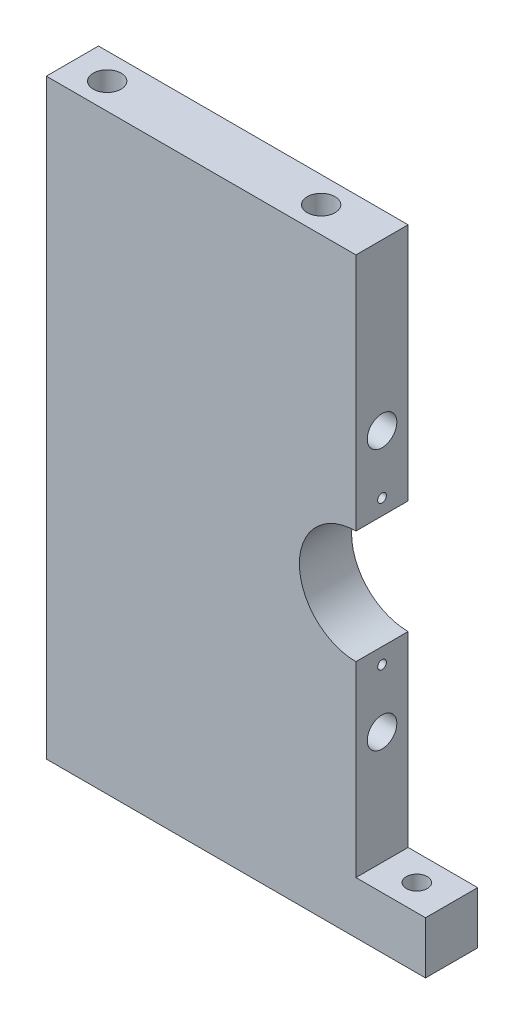
ISO-10303-21;
HEADER;
FILE_DESCRIPTION(('STEP AP214'),'2;1');
FILE_NAME('part.step','',(''),(''),'','','');
FILE_SCHEMA(('AUTOMOTIVE_DESIGN { 1 0 10303 214 1 1 1 1 }'));
ENDSEC;
DATA;
#1=APPLICATION_CONTEXT('core data for automotive mechanical design processes');
#2=APPLICATION_PROTOCOL_DEFINITION('international standard','automotive_design',2000,#1);
#3=PRODUCT_CONTEXT('',#1,'mechanical');
#4=PRODUCT('Part','Part','',(#3));
#5=PRODUCT_RELATED_PRODUCT_CATEGORY('part','',(#4));
#6=PRODUCT_DEFINITION_FORMATION('','',#4);
#7=PRODUCT_DEFINITION_CONTEXT('part definition',#1,'design');
#8=PRODUCT_DEFINITION('design','',#6,#7);
#9=PRODUCT_DEFINITION_SHAPE('','',#8);
#10=(LENGTH_UNIT() NAMED_UNIT(*) SI_UNIT(.MILLI.,.METRE.));
#11=(NAMED_UNIT(*) PLANE_ANGLE_UNIT() SI_UNIT($,.RADIAN.));
#12=(NAMED_UNIT(*) SI_UNIT($,.STERADIAN.) SOLID_ANGLE_UNIT());
#13=UNCERTAINTY_MEASURE_WITH_UNIT(LENGTH_MEASURE(1.E-05),#10,'distance_accuracy_value','');
#14=(GEOMETRIC_REPRESENTATION_CONTEXT(3) GLOBAL_UNCERTAINTY_ASSIGNED_CONTEXT((#13)) GLOBAL_UNIT_ASSIGNED_CONTEXT((#10,
#11,#12)) REPRESENTATION_CONTEXT('',''));
#15=CARTESIAN_POINT('',(0.,0.,0.));
#16=DIRECTION('',(0.,0.,1.));
#17=DIRECTION('',(1.,0.,0.));
#18=AXIS2_PLACEMENT_3D('',#15,#16,#17);
#19=CARTESIAN_POINT('',(218.,0.,30.));
#20=DIRECTION('',(0.,1.,0.));
#21=DIRECTION('',(-1.,0.,0.));
#22=AXIS2_PLACEMENT_3D('',#19,#20,#21);
#23=PLANE('',#22);
#24=CARTESIAN_POINT('',(198.,0.,15.));
#25=DIRECTION('',(0.,1.,0.));
#26=DIRECTION('',(-1.,0.,0.));
#27=AXIS2_PLACEMENT_3D('',#24,#25,#26);
#28=CIRCLE('',#27,6.00000000000002);
#29=CARTESIAN_POINT('',(192.,0.,15.));
#30=VERTEX_POINT('',#29);
#31=EDGE_CURVE('E201',#30,#30,#28,.T.);
#32=ORIENTED_EDGE('',*,*,#31,.T.);
#33=EDGE_LOOP('',(#32));
#34=FACE_BOUND('',#33,.T.);
#35=DIRECTION('',(1.,0.,0.));
#36=VECTOR('',#35,1.);
#37=CARTESIAN_POINT('',(218.,0.,0.));
#38=LINE('',#37,#36);
#39=CARTESIAN_POINT('',(0.,0.,0.));
#40=VERTEX_POINT('',#39);
#41=CARTESIAN_POINT('',(218.,0.,0.));
#42=VERTEX_POINT('',#41);
#43=EDGE_CURVE('E132',#40,#42,#38,.T.);
#44=ORIENTED_EDGE('',*,*,#43,.T.);
#45=DIRECTION('',(0.,0.,-1.));
#46=VECTOR('',#45,1.);
#47=CARTESIAN_POINT('',(218.,0.,30.));
#48=LINE('',#47,#46);
#49=CARTESIAN_POINT('',(218.,0.,30.));
#50=VERTEX_POINT('',#49);
#51=EDGE_CURVE('E11',#50,#42,#48,.T.);
#52=ORIENTED_EDGE('',*,*,#51,.F.);
#53=DIRECTION('',(1.,0.,0.));
#54=VECTOR('',#53,1.);
#55=CARTESIAN_POINT('',(218.,0.,30.));
#56=LINE('',#55,#54);
#57=CARTESIAN_POINT('',(0.,0.,30.));
#58=VERTEX_POINT('',#57);
#59=EDGE_CURVE('E147',#58,#50,#56,.T.);
#60=ORIENTED_EDGE('',*,*,#59,.F.);
#61=DIRECTION('',(0.,0.,-1.));
#62=VECTOR('',#61,1.);
#63=CARTESIAN_POINT('',(0.,0.,30.));
#64=LINE('',#63,#62);
#65=EDGE_CURVE('E128',#58,#40,#64,.T.);
#66=ORIENTED_EDGE('',*,*,#65,.T.);
#67=EDGE_LOOP('',(#44,#52,#60,#66));
#68=FACE_BOUND('',#67,.T.);
#69=ADVANCED_FACE('F36',(#34,#68),#23,.F.);
#70=CARTESIAN_POINT('',(218.,30.,30.));
#71=DIRECTION('',(-1.,0.,0.));
#72=DIRECTION('',(0.,0.,1.));
#73=AXIS2_PLACEMENT_3D('',#70,#71,#72);
#74=PLANE('',#73);
#75=DIRECTION('',(0.,1.,0.));
#76=VECTOR('',#75,1.);
#77=CARTESIAN_POINT('',(218.,30.,0.));
#78=LINE('',#77,#76);
#79=CARTESIAN_POINT('',(218.,30.,0.));
#80=VERTEX_POINT('',#79);
#81=EDGE_CURVE('E135',#42,#80,#78,.T.);
#82=ORIENTED_EDGE('',*,*,#81,.T.);
#83=DIRECTION('',(0.,0.,-1.));
#84=VECTOR('',#83,1.);
#85=CARTESIAN_POINT('',(218.,30.,30.));
#86=LINE('',#85,#84);
#87=CARTESIAN_POINT('',(218.,30.,30.));
#88=VERTEX_POINT('',#87);
#89=EDGE_CURVE('E44',#88,#80,#86,.T.);
#90=ORIENTED_EDGE('',*,*,#89,.F.);
#91=DIRECTION('',(0.,1.,0.));
#92=VECTOR('',#91,1.);
#93=CARTESIAN_POINT('',(218.,30.,30.));
#94=LINE('',#93,#92);
#95=EDGE_CURVE('E95',#50,#88,#94,.T.);
#96=ORIENTED_EDGE('',*,*,#95,.F.);
#97=ORIENTED_EDGE('',*,*,#51,.T.);
#98=EDGE_LOOP('',(#82,#90,#96,#97));
#99=FACE_BOUND('',#98,.T.);
#100=ADVANCED_FACE('F253',(#99),#74,.F.);
#101=CARTESIAN_POINT('',(178.,30.,30.));
#102=DIRECTION('',(0.,-1.,0.));
#103=DIRECTION('',(1.,0.,0.));
#104=AXIS2_PLACEMENT_3D('',#101,#102,#103);
#105=PLANE('',#104);
#106=CARTESIAN_POINT('',(198.,30.,15.));
#107=DIRECTION('',(0.,1.,0.));
#108=DIRECTION('',(-1.,0.,0.));
#109=AXIS2_PLACEMENT_3D('',#106,#107,#108);
#110=CIRCLE('',#109,6.00000000000002);
#111=CARTESIAN_POINT('',(192.,30.,15.));
#112=VERTEX_POINT('',#111);
#113=EDGE_CURVE('E204',#112,#112,#110,.T.);
#114=ORIENTED_EDGE('',*,*,#113,.F.);
#115=EDGE_LOOP('',(#114));
#116=FACE_BOUND('',#115,.T.);
#117=DIRECTION('',(-1.,0.,0.));
#118=VECTOR('',#117,1.);
#119=CARTESIAN_POINT('',(178.,30.,0.));
#120=LINE('',#119,#118);
#121=CARTESIAN_POINT('',(178.,30.,0.));
#122=VERTEX_POINT('',#121);
#123=EDGE_CURVE('E138',#80,#122,#120,.T.);
#124=ORIENTED_EDGE('',*,*,#123,.T.);
#125=DIRECTION('',(0.,0.,-1.));
#126=VECTOR('',#125,1.);
#127=CARTESIAN_POINT('',(178.,30.,30.));
#128=LINE('',#127,#126);
#129=CARTESIAN_POINT('',(178.,30.,30.));
#130=VERTEX_POINT('',#129);
#131=EDGE_CURVE('E154',#130,#122,#128,.T.);
#132=ORIENTED_EDGE('',*,*,#131,.F.);
#133=DIRECTION('',(-1.,0.,0.));
#134=VECTOR('',#133,1.);
#135=CARTESIAN_POINT('',(178.,30.,30.));
#136=LINE('',#135,#134);
#137=EDGE_CURVE('E162',#88,#130,#136,.T.);
#138=ORIENTED_EDGE('',*,*,#137,.F.);
#139=ORIENTED_EDGE('',*,*,#89,.T.);
#140=EDGE_LOOP('',(#124,#132,#138,#139));
#141=FACE_BOUND('',#140,.T.);
#142=ADVANCED_FACE('F160',(#116,#141),#105,.F.);
#143=CARTESIAN_POINT('',(178.,137.5,30.));
#144=DIRECTION('',(-1.,0.,0.));
#145=DIRECTION('',(0.,-1.,0.));
#146=AXIS2_PLACEMENT_3D('',#143,#144,#145);
#147=PLANE('',#146);
#148=CARTESIAN_POINT('',(178.,128.5,15.));
#149=DIRECTION('',(1.,0.,0.));
#150=DIRECTION('',(0.,1.,0.));
#151=AXIS2_PLACEMENT_3D('',#148,#149,#150);
#152=CIRCLE('',#151,2.5);
#153=CARTESIAN_POINT('',(178.,131.,15.));
#154=VERTEX_POINT('',#153);
#155=EDGE_CURVE('E192',#154,#154,#152,.T.);
#156=ORIENTED_EDGE('',*,*,#155,.F.);
#157=EDGE_LOOP('',(#156));
#158=FACE_BOUND('',#157,.T.);
#159=CARTESIAN_POINT('',(178.,95.,15.));
#160=DIRECTION('',(1.,0.,0.));
#161=DIRECTION('',(0.,1.,0.));
#162=AXIS2_PLACEMENT_3D('',#159,#160,#161);
#163=CIRCLE('',#162,8.50000000000001);
#164=CARTESIAN_POINT('',(178.,103.5,15.));
#165=VERTEX_POINT('',#164);
#166=EDGE_CURVE('E180',#165,#165,#163,.T.);
#167=ORIENTED_EDGE('',*,*,#166,.F.);
#168=EDGE_LOOP('',(#167));
#169=FACE_BOUND('',#168,.T.);
#170=DIRECTION('',(0.,1.,0.));
#171=VECTOR('',#170,1.);
#172=CARTESIAN_POINT('',(178.,137.5,0.));
#173=LINE('',#172,#171);
#174=CARTESIAN_POINT('',(178.,137.5,0.));
#175=VERTEX_POINT('',#174);
#176=EDGE_CURVE('E140',#122,#175,#173,.T.);
#177=ORIENTED_EDGE('',*,*,#176,.T.);
#178=DIRECTION('',(0.,0.,-1.));
#179=VECTOR('',#178,1.);
#180=CARTESIAN_POINT('',(178.,137.5,30.));
#181=LINE('',#180,#179);
#182=CARTESIAN_POINT('',(178.,137.5,30.));
#183=VERTEX_POINT('',#182);
#184=EDGE_CURVE('E151',#183,#175,#181,.T.);
#185=ORIENTED_EDGE('',*,*,#184,.F.);
#186=DIRECTION('',(0.,1.,0.));
#187=VECTOR('',#186,1.);
#188=CARTESIAN_POINT('',(178.,137.5,30.));
#189=LINE('',#188,#187);
#190=EDGE_CURVE('E174',#130,#183,#189,.T.);
#191=ORIENTED_EDGE('',*,*,#190,.F.);
#192=ORIENTED_EDGE('',*,*,#131,.T.);
#193=EDGE_LOOP('',(#177,#185,#191,#192));
#194=FACE_BOUND('',#193,.T.);
#195=ADVANCED_FACE('F170',(#158,#169,#194),#147,.F.);
#196=CARTESIAN_POINT('',(178.,170.,30.));
#197=DIRECTION('',(0.,0.,-1.));
#198=DIRECTION('',(-1.,0.,0.));
#199=AXIS2_PLACEMENT_3D('',#196,#197,#198);
#200=CYLINDRICAL_SURFACE('',#199,32.5);
#201=CARTESIAN_POINT('',(178.,170.,0.));
#202=DIRECTION('',(0.,0.,-1.));
#203=DIRECTION('',(1.,0.,0.));
#204=AXIS2_PLACEMENT_3D('',#201,#202,#203);
#205=CIRCLE('',#204,32.5);
#206=CARTESIAN_POINT('',(178.,202.5,0.));
#207=VERTEX_POINT('',#206);
#208=EDGE_CURVE('E142',#175,#207,#205,.T.);
#209=ORIENTED_EDGE('',*,*,#208,.T.);
#210=DIRECTION('',(0.,0.,-1.));
#211=VECTOR('',#210,1.);
#212=CARTESIAN_POINT('',(178.,202.5,30.));
#213=LINE('',#212,#211);
#214=CARTESIAN_POINT('',(178.,202.5,30.));
#215=VERTEX_POINT('',#214);
#216=EDGE_CURVE('E123',#215,#207,#213,.T.);
#217=ORIENTED_EDGE('',*,*,#216,.F.);
#218=CARTESIAN_POINT('',(178.,170.,30.));
#219=DIRECTION('',(0.,0.,-1.));
#220=DIRECTION('',(1.,0.,0.));
#221=AXIS2_PLACEMENT_3D('',#218,#219,#220);
#222=CIRCLE('',#221,32.5);
#223=EDGE_CURVE('E114',#183,#215,#222,.T.);
#224=ORIENTED_EDGE('',*,*,#223,.F.);
#225=ORIENTED_EDGE('',*,*,#184,.T.);
#226=EDGE_LOOP('',(#209,#217,#224,#225));
#227=FACE_BOUND('',#226,.T.);
#228=ADVANCED_FACE('F173',(#227),#200,.F.);
#229=CARTESIAN_POINT('',(178.,340.,30.));
#230=DIRECTION('',(-1.,0.,0.));
#231=DIRECTION('',(0.,-1.,0.));
#232=AXIS2_PLACEMENT_3D('',#229,#230,#231);
#233=PLANE('',#232);
#234=CARTESIAN_POINT('',(178.,211.5,15.));
#235=DIRECTION('',(1.,0.,0.));
#236=DIRECTION('',(0.,1.,0.));
#237=AXIS2_PLACEMENT_3D('',#234,#235,#236);
#238=CIRCLE('',#237,2.5);
#239=CARTESIAN_POINT('',(178.,214.,15.));
#240=VERTEX_POINT('',#239);
#241=EDGE_CURVE('E198',#240,#240,#238,.T.);
#242=ORIENTED_EDGE('',*,*,#241,.F.);
#243=EDGE_LOOP('',(#242));
#244=FACE_BOUND('',#243,.T.);
#245=CARTESIAN_POINT('',(178.,245.,15.));
#246=DIRECTION('',(1.,0.,0.));
#247=DIRECTION('',(0.,1.,0.));
#248=AXIS2_PLACEMENT_3D('',#245,#246,#247);
#249=CIRCLE('',#248,8.50000000000001);
#250=CARTESIAN_POINT('',(178.,253.5,15.));
#251=VERTEX_POINT('',#250);
#252=EDGE_CURVE('E186',#251,#251,#249,.T.);
#253=ORIENTED_EDGE('',*,*,#252,.F.);
#254=EDGE_LOOP('',(#253));
#255=FACE_BOUND('',#254,.T.);
#256=DIRECTION('',(0.,1.,0.));
#257=VECTOR('',#256,1.);
#258=CARTESIAN_POINT('',(178.,340.,0.));
#259=LINE('',#258,#257);
#260=CARTESIAN_POINT('',(178.,340.,0.));
#261=VERTEX_POINT('',#260);
#262=EDGE_CURVE('E122',#207,#261,#259,.T.);
#263=ORIENTED_EDGE('',*,*,#262,.T.);
#264=DIRECTION('',(0.,0.,-1.));
#265=VECTOR('',#264,1.);
#266=CARTESIAN_POINT('',(178.,340.,30.));
#267=LINE('',#266,#265);
#268=CARTESIAN_POINT('',(178.,340.,30.));
#269=VERTEX_POINT('',#268);
#270=EDGE_CURVE('E119',#269,#261,#267,.T.);
#271=ORIENTED_EDGE('',*,*,#270,.F.);
#272=DIRECTION('',(0.,1.,0.));
#273=VECTOR('',#272,1.);
#274=CARTESIAN_POINT('',(178.,340.,30.));
#275=LINE('',#274,#273);
#276=EDGE_CURVE('E108',#215,#269,#275,.T.);
#277=ORIENTED_EDGE('',*,*,#276,.F.);
#278=ORIENTED_EDGE('',*,*,#216,.T.);
#279=EDGE_LOOP('',(#263,#271,#277,#278));
#280=FACE_BOUND('',#279,.T.);
#281=ADVANCED_FACE('F120',(#244,#255,#280),#233,.F.);
#282=CARTESIAN_POINT('',(0.,340.,30.));
#283=DIRECTION('',(0.,-1.,0.));
#284=DIRECTION('',(0.,0.,-1.));
#285=AXIS2_PLACEMENT_3D('',#282,#283,#284);
#286=PLANE('',#285);
#287=CARTESIAN_POINT('',(20.,340.,15.));
#288=DIRECTION('',(0.,1.,0.));
#289=DIRECTION('',(0.,0.,1.));
#290=AXIS2_PLACEMENT_3D('',#287,#288,#289);
#291=CIRCLE('',#290,8.);
#292=CARTESIAN_POINT('',(20.,340.,23.));
#293=VERTEX_POINT('',#292);
#294=EDGE_CURVE('E216',#293,#293,#291,.T.);
#295=ORIENTED_EDGE('',*,*,#294,.F.);
#296=EDGE_LOOP('',(#295));
#297=FACE_BOUND('',#296,.T.);
#298=CARTESIAN_POINT('',(143.,340.,15.));
#299=DIRECTION('',(0.,1.,0.));
#300=DIRECTION('',(0.,0.,1.));
#301=AXIS2_PLACEMENT_3D('',#298,#299,#300);
#302=CIRCLE('',#301,8.00000000000001);
#303=CARTESIAN_POINT('',(143.,340.,23.));
#304=VERTEX_POINT('',#303);
#305=EDGE_CURVE('E210',#304,#304,#302,.T.);
#306=ORIENTED_EDGE('',*,*,#305,.F.);
#307=EDGE_LOOP('',(#306));
#308=FACE_BOUND('',#307,.T.);
#309=DIRECTION('',(-1.,0.,0.));
#310=VECTOR('',#309,1.);
#311=CARTESIAN_POINT('',(0.,340.,0.));
#312=LINE('',#311,#310);
#313=CARTESIAN_POINT('',(0.,340.,0.));
#314=VERTEX_POINT('',#313);
#315=EDGE_CURVE('E81',#261,#314,#312,.T.);
#316=ORIENTED_EDGE('',*,*,#315,.T.);
#317=DIRECTION('',(0.,0.,-1.));
#318=VECTOR('',#317,1.);
#319=CARTESIAN_POINT('',(0.,340.,30.));
#320=LINE('',#319,#318);
#321=CARTESIAN_POINT('',(0.,340.,30.));
#322=VERTEX_POINT('',#321);
#323=EDGE_CURVE('E124',#322,#314,#320,.T.);
#324=ORIENTED_EDGE('',*,*,#323,.F.);
#325=DIRECTION('',(-1.,0.,0.));
#326=VECTOR('',#325,1.);
#327=CARTESIAN_POINT('',(0.,340.,30.));
#328=LINE('',#327,#326);
#329=EDGE_CURVE('E112',#269,#322,#328,.T.);
#330=ORIENTED_EDGE('',*,*,#329,.F.);
#331=ORIENTED_EDGE('',*,*,#270,.T.);
#332=EDGE_LOOP('',(#316,#324,#330,#331));
#333=FACE_BOUND('',#332,.T.);
#334=ADVANCED_FACE('F126',(#297,#308,#333),#286,.F.);
#335=CARTESIAN_POINT('',(0.,0.,30.));
#336=DIRECTION('',(1.,0.,0.));
#337=DIRECTION('',(0.,0.,-1.));
#338=AXIS2_PLACEMENT_3D('',#335,#336,#337);
#339=PLANE('',#338);
#340=CARTESIAN_POINT('',(-1.94289029309402E-13,245.,15.));
#341=DIRECTION('',(1.,0.,0.));
#342=DIRECTION('',(0.,1.,0.));
#343=AXIS2_PLACEMENT_3D('',#340,#341,#342);
#344=CIRCLE('',#343,8.50000000000001);
#345=CARTESIAN_POINT('',(-1.98678283127688E-13,253.5,15.));
#346=VERTEX_POINT('',#345);
#347=EDGE_CURVE('E183',#346,#346,#344,.T.);
#348=ORIENTED_EDGE('',*,*,#347,.T.);
#349=EDGE_LOOP('',(#348));
#350=FACE_BOUND('',#349,.T.);
#351=CARTESIAN_POINT('',(0.,94.9999999999999,15.));
#352=DIRECTION('',(1.,0.,0.));
#353=DIRECTION('',(0.,1.,0.));
#354=AXIS2_PLACEMENT_3D('',#351,#352,#353);
#355=CIRCLE('',#354,8.50000000000001);
#356=CARTESIAN_POINT('',(0.,103.5,15.));
#357=VERTEX_POINT('',#356);
#358=EDGE_CURVE('E136',#357,#357,#355,.T.);
#359=ORIENTED_EDGE('',*,*,#358,.T.);
#360=EDGE_LOOP('',(#359));
#361=FACE_BOUND('',#360,.T.);
#362=DIRECTION('',(0.,-1.,0.));
#363=VECTOR('',#362,1.);
#364=CARTESIAN_POINT('',(0.,0.,0.));
#365=LINE('',#364,#363);
#366=EDGE_CURVE('E87',#314,#40,#365,.T.);
#367=ORIENTED_EDGE('',*,*,#366,.T.);
#368=ORIENTED_EDGE('',*,*,#65,.F.);
#369=DIRECTION('',(0.,-1.,0.));
#370=VECTOR('',#369,1.);
#371=CARTESIAN_POINT('',(0.,0.,30.));
#372=LINE('',#371,#370);
#373=EDGE_CURVE('E52',#322,#58,#372,.T.);
#374=ORIENTED_EDGE('',*,*,#373,.F.);
#375=ORIENTED_EDGE('',*,*,#323,.T.);
#376=EDGE_LOOP('',(#367,#368,#374,#375));
#377=FACE_BOUND('',#376,.T.);
#378=ADVANCED_FACE('F233',(#350,#361,#377),#339,.F.);
#379=CARTESIAN_POINT('',(178.,170.,30.));
#380=DIRECTION('',(0.,0.,1.));
#381=DIRECTION('',(1.,0.,0.));
#382=AXIS2_PLACEMENT_3D('',#379,#380,#381);
#383=PLANE('',#382);
#384=ORIENTED_EDGE('',*,*,#59,.T.);
#385=ORIENTED_EDGE('',*,*,#95,.T.);
#386=ORIENTED_EDGE('',*,*,#137,.T.);
#387=ORIENTED_EDGE('',*,*,#190,.T.);
#388=ORIENTED_EDGE('',*,*,#223,.T.);
#389=ORIENTED_EDGE('',*,*,#276,.T.);
#390=ORIENTED_EDGE('',*,*,#329,.T.);
#391=ORIENTED_EDGE('',*,*,#373,.T.);
#392=EDGE_LOOP('',(#384,#385,#386,#387,#388,#389,#390,#391));
#393=FACE_BOUND('',#392,.T.);
#394=ADVANCED_FACE('F110',(#393),#383,.T.);
#395=CARTESIAN_POINT('',(178.,170.,0.));
#396=DIRECTION('',(0.,0.,1.));
#397=DIRECTION('',(1.,0.,0.));
#398=AXIS2_PLACEMENT_3D('',#395,#396,#397);
#399=PLANE('',#398);
#400=ORIENTED_EDGE('',*,*,#43,.F.);
#401=ORIENTED_EDGE('',*,*,#366,.F.);
#402=ORIENTED_EDGE('',*,*,#315,.F.);
#403=ORIENTED_EDGE('',*,*,#262,.F.);
#404=ORIENTED_EDGE('',*,*,#208,.F.);
#405=ORIENTED_EDGE('',*,*,#176,.F.);
#406=ORIENTED_EDGE('',*,*,#123,.F.);
#407=ORIENTED_EDGE('',*,*,#81,.F.);
#408=EDGE_LOOP('',(#400,#401,#402,#403,#404,#405,#406,#407));
#409=FACE_BOUND('',#408,.T.);
#410=ADVANCED_FACE('F166',(#409),#399,.F.);
#411=CARTESIAN_POINT('',(0.,94.9999999999999,15.));
#412=DIRECTION('',(1.,0.,0.));
#413=DIRECTION('',(0.,1.,0.));
#414=AXIS2_PLACEMENT_3D('',#411,#412,#413);
#415=CYLINDRICAL_SURFACE('',#414,8.50000000000001);
#416=ORIENTED_EDGE('',*,*,#358,.F.);
#417=EDGE_LOOP('',(#416));
#418=FACE_BOUND('',#417,.T.);
#419=ORIENTED_EDGE('',*,*,#166,.T.);
#420=EDGE_LOOP('',(#419));
#421=FACE_BOUND('',#420,.T.);
#422=ADVANCED_FACE('F381',(#418,#421),#415,.F.);
#423=CARTESIAN_POINT('',(-1.94289029309402E-13,245.,15.));
#424=DIRECTION('',(1.,0.,0.));
#425=DIRECTION('',(0.,1.,0.));
#426=AXIS2_PLACEMENT_3D('',#423,#424,#425);
#427=CYLINDRICAL_SURFACE('',#426,8.50000000000001);
#428=ORIENTED_EDGE('',*,*,#347,.F.);
#429=EDGE_LOOP('',(#428));
#430=FACE_BOUND('',#429,.T.);
#431=ORIENTED_EDGE('',*,*,#252,.T.);
#432=EDGE_LOOP('',(#431));
#433=FACE_BOUND('',#432,.T.);
#434=ADVANCED_FACE('F373',(#430,#433),#427,.F.);
#435=CARTESIAN_POINT('',(163.,128.5,15.));
#436=DIRECTION('',(1.,0.,0.));
#437=DIRECTION('',(0.,1.,0.));
#438=AXIS2_PLACEMENT_3D('',#435,#436,#437);
#439=CYLINDRICAL_SURFACE('',#438,2.5);
#440=CARTESIAN_POINT('',(163.,128.5,15.));
#441=DIRECTION('',(1.,0.,0.));
#442=DIRECTION('',(0.,1.,0.));
#443=AXIS2_PLACEMENT_3D('',#440,#441,#442);
#444=CIRCLE('',#443,2.5);
#445=CARTESIAN_POINT('',(163.,131.,15.));
#446=VERTEX_POINT('',#445);
#447=EDGE_CURVE('E189',#446,#446,#444,.T.);
#448=ORIENTED_EDGE('',*,*,#447,.F.);
#449=EDGE_LOOP('',(#448));
#450=FACE_BOUND('',#449,.T.);
#451=ORIENTED_EDGE('',*,*,#155,.T.);
#452=EDGE_LOOP('',(#451));
#453=FACE_BOUND('',#452,.T.);
#454=ADVANCED_FACE('F365',(#450,#453),#439,.F.);
#455=CARTESIAN_POINT('',(163.,128.5,15.));
#456=DIRECTION('',(1.,0.,0.));
#457=DIRECTION('',(0.,1.,0.));
#458=AXIS2_PLACEMENT_3D('',#455,#456,#457);
#459=PLANE('',#458);
#460=ORIENTED_EDGE('',*,*,#447,.T.);
#461=EDGE_LOOP('',(#460));
#462=FACE_BOUND('',#461,.T.);
#463=ADVANCED_FACE('F357',(#462),#459,.T.);
#464=CARTESIAN_POINT('',(163.,211.5,15.));
#465=DIRECTION('',(1.,0.,0.));
#466=DIRECTION('',(0.,1.,0.));
#467=AXIS2_PLACEMENT_3D('',#464,#465,#466);
#468=CYLINDRICAL_SURFACE('',#467,2.5);
#469=CARTESIAN_POINT('',(163.,211.5,15.));
#470=DIRECTION('',(1.,0.,0.));
#471=DIRECTION('',(0.,1.,0.));
#472=AXIS2_PLACEMENT_3D('',#469,#470,#471);
#473=CIRCLE('',#472,2.5);
#474=CARTESIAN_POINT('',(163.,214.,15.));
#475=VERTEX_POINT('',#474);
#476=EDGE_CURVE('E195',#475,#475,#473,.T.);
#477=ORIENTED_EDGE('',*,*,#476,.F.);
#478=EDGE_LOOP('',(#477));
#479=FACE_BOUND('',#478,.T.);
#480=ORIENTED_EDGE('',*,*,#241,.T.);
#481=EDGE_LOOP('',(#480));
#482=FACE_BOUND('',#481,.T.);
#483=ADVANCED_FACE('F349',(#479,#482),#468,.F.);
#484=CARTESIAN_POINT('',(163.,211.5,15.));
#485=DIRECTION('',(1.,0.,0.));
#486=DIRECTION('',(0.,1.,0.));
#487=AXIS2_PLACEMENT_3D('',#484,#485,#486);
#488=PLANE('',#487);
#489=ORIENTED_EDGE('',*,*,#476,.T.);
#490=EDGE_LOOP('',(#489));
#491=FACE_BOUND('',#490,.T.);
#492=ADVANCED_FACE('F248',(#491),#488,.T.);
#493=CARTESIAN_POINT('',(198.,0.,15.));
#494=DIRECTION('',(0.,1.,0.));
#495=DIRECTION('',(-1.,0.,0.));
#496=AXIS2_PLACEMENT_3D('',#493,#494,#495);
#497=CYLINDRICAL_SURFACE('',#496,6.00000000000002);
#498=ORIENTED_EDGE('',*,*,#31,.F.);
#499=EDGE_LOOP('',(#498));
#500=FACE_BOUND('',#499,.T.);
#501=ORIENTED_EDGE('',*,*,#113,.T.);
#502=EDGE_LOOP('',(#501));
#503=FACE_BOUND('',#502,.T.);
#504=ADVANCED_FACE('F239',(#500,#503),#497,.F.);
#505=CARTESIAN_POINT('',(143.,300.,15.));
#506=DIRECTION('',(0.,1.,0.));
#507=DIRECTION('',(0.,0.,1.));
#508=AXIS2_PLACEMENT_3D('',#505,#506,#507);
#509=CYLINDRICAL_SURFACE('',#508,8.00000000000001);
#510=CARTESIAN_POINT('',(143.,300.,15.));
#511=DIRECTION('',(0.,1.,0.));
#512=DIRECTION('',(0.,0.,1.));
#513=AXIS2_PLACEMENT_3D('',#510,#511,#512);
#514=CIRCLE('',#513,8.00000000000001);
#515=CARTESIAN_POINT('',(143.,300.,23.));
#516=VERTEX_POINT('',#515);
#517=EDGE_CURVE('E213',#516,#516,#514,.T.);
#518=ORIENTED_EDGE('',*,*,#517,.F.);
#519=EDGE_LOOP('',(#518));
#520=FACE_BOUND('',#519,.T.);
#521=ORIENTED_EDGE('',*,*,#305,.T.);
#522=EDGE_LOOP('',(#521));
#523=FACE_BOUND('',#522,.T.);
#524=ADVANCED_FACE('F237',(#520,#523),#509,.F.);
#525=CARTESIAN_POINT('',(143.,300.,15.));
#526=DIRECTION('',(0.,1.,0.));
#527=DIRECTION('',(0.,0.,1.));
#528=AXIS2_PLACEMENT_3D('',#525,#526,#527);
#529=PLANE('',#528);
#530=ORIENTED_EDGE('',*,*,#517,.T.);
#531=EDGE_LOOP('',(#530));
#532=FACE_BOUND('',#531,.T.);
#533=ADVANCED_FACE('F227',(#532),#529,.T.);
#534=CARTESIAN_POINT('',(20.,300.,15.));
#535=DIRECTION('',(0.,1.,0.));
#536=DIRECTION('',(0.,0.,1.));
#537=AXIS2_PLACEMENT_3D('',#534,#535,#536);
#538=CYLINDRICAL_SURFACE('',#537,8.);
#539=CARTESIAN_POINT('',(20.,300.,15.));
#540=DIRECTION('',(0.,1.,0.));
#541=DIRECTION('',(0.,0.,1.));
#542=AXIS2_PLACEMENT_3D('',#539,#540,#541);
#543=CIRCLE('',#542,8.);
#544=CARTESIAN_POINT('',(20.,300.,23.));
#545=VERTEX_POINT('',#544);
#546=EDGE_CURVE('E207',#545,#545,#543,.T.);
#547=ORIENTED_EDGE('',*,*,#546,.F.);
#548=EDGE_LOOP('',(#547));
#549=FACE_BOUND('',#548,.T.);
#550=ORIENTED_EDGE('',*,*,#294,.T.);
#551=EDGE_LOOP('',(#550));
#552=FACE_BOUND('',#551,.T.);
#553=ADVANCED_FACE('F224',(#549,#552),#538,.F.);
#554=CARTESIAN_POINT('',(20.,300.,15.));
#555=DIRECTION('',(0.,1.,0.));
#556=DIRECTION('',(0.,0.,1.));
#557=AXIS2_PLACEMENT_3D('',#554,#555,#556);
#558=PLANE('',#557);
#559=ORIENTED_EDGE('',*,*,#546,.T.);
#560=EDGE_LOOP('',(#559));
#561=FACE_BOUND('',#560,.T.);
#562=ADVANCED_FACE('F222',(#561),#558,.T.);
#563=CLOSED_SHELL('',(#69,#100,#142,#195,#228,#281,#334,#378,#394,#410,#422,#434,#454,#463,#483,
#492,#504,#524,#533,#553,#562));
#564=MANIFOLD_SOLID_BREP('B2',#563);
#565=ADVANCED_BREP_SHAPE_REPRESENTATION('',(#18,#564),#14);
#566=SHAPE_DEFINITION_REPRESENTATION(#9,#565);
ENDSEC;
END-ISO-10303-21;
